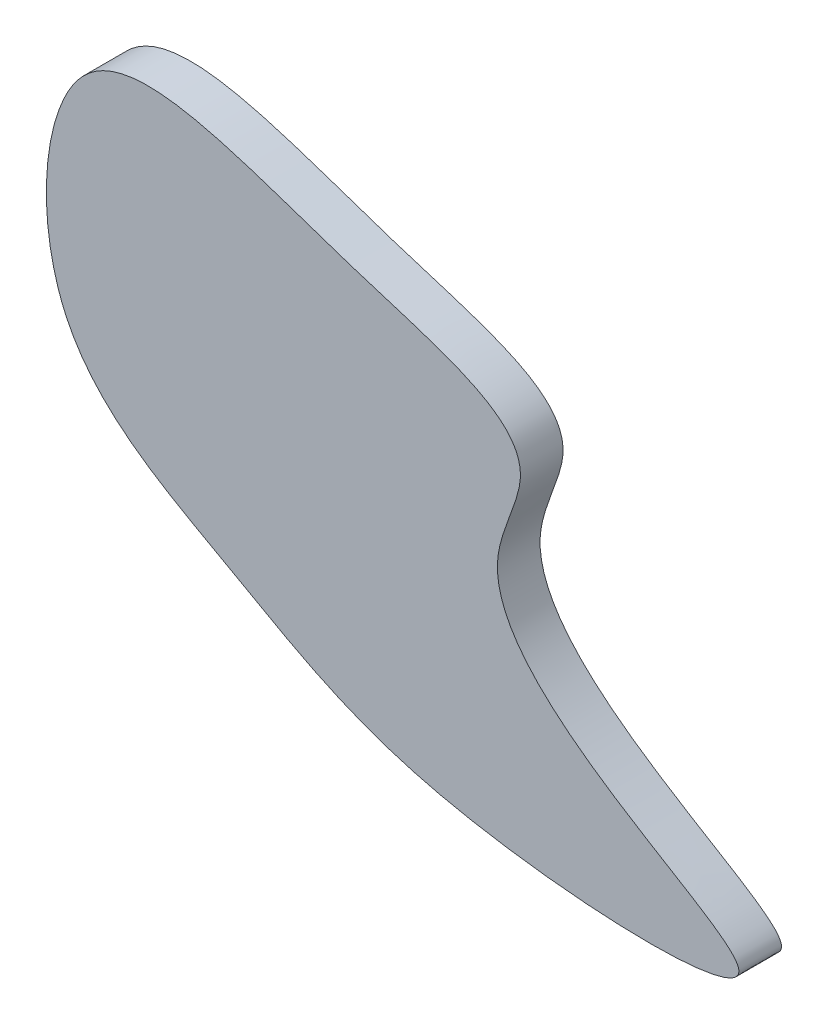
ISO-10303-21;
HEADER;
FILE_DESCRIPTION(('STEP AP214'),'2;1');
FILE_NAME('part.step','',(''),(''),'','','');
FILE_SCHEMA(('AUTOMOTIVE_DESIGN { 1 0 10303 214 1 1 1 1 }'));
ENDSEC;
DATA;
#1=APPLICATION_CONTEXT('core data for automotive mechanical design processes');
#2=APPLICATION_PROTOCOL_DEFINITION('international standard','automotive_design',2000,#1);
#3=PRODUCT_CONTEXT('',#1,'mechanical');
#4=PRODUCT('Part','Part','',(#3));
#5=PRODUCT_RELATED_PRODUCT_CATEGORY('part','',(#4));
#6=PRODUCT_DEFINITION_FORMATION('','',#4);
#7=PRODUCT_DEFINITION_CONTEXT('part definition',#1,'design');
#8=PRODUCT_DEFINITION('design','',#6,#7);
#9=PRODUCT_DEFINITION_SHAPE('','',#8);
#10=(LENGTH_UNIT() NAMED_UNIT(*) SI_UNIT(.MILLI.,.METRE.));
#11=(NAMED_UNIT(*) PLANE_ANGLE_UNIT() SI_UNIT($,.RADIAN.));
#12=(NAMED_UNIT(*) SI_UNIT($,.STERADIAN.) SOLID_ANGLE_UNIT());
#13=UNCERTAINTY_MEASURE_WITH_UNIT(LENGTH_MEASURE(1.E-05),#10,'distance_accuracy_value','');
#14=(GEOMETRIC_REPRESENTATION_CONTEXT(3) GLOBAL_UNCERTAINTY_ASSIGNED_CONTEXT((#13)) GLOBAL_UNIT_ASSIGNED_CONTEXT((#10,
#11,#12)) REPRESENTATION_CONTEXT('',''));
#15=CARTESIAN_POINT('',(0.,0.,0.));
#16=DIRECTION('',(0.,0.,1.));
#17=DIRECTION('',(1.,0.,0.));
#18=AXIS2_PLACEMENT_3D('',#15,#16,#17);
#19=CARTESIAN_POINT('',(-80.5382280056128,16.1125896796063,10.));
#20=CARTESIAN_POINT('',(-73.2223940572837,0.47451906370475,10.));
#21=CARTESIAN_POINT('',(-39.7737839332765,-16.204726599276,10.));
#22=CARTESIAN_POINT('',(0.660761158764566,-42.2798150218325,10.));
#23=CARTESIAN_POINT('',(127.962480815581,-47.4058385253257,10.));
#24=CARTESIAN_POINT('',(3.66498318277631,-3.73898254964805,10.));
#25=CARTESIAN_POINT('',(35.3577023898568,46.6962845426519,10.));
#26=CARTESIAN_POINT('',(-22.5259972455042,60.0214117269627,10.));
#27=CARTESIAN_POINT('',(-83.5489155866873,88.8453181613764,10.));
#28=CARTESIAN_POINT('',(-88.2095845352318,32.510612923059,10.));
#29=CARTESIAN_POINT('',(-80.5382280056128,16.1125896796063,10.));
#30=B_SPLINE_CURVE_WITH_KNOTS('',3,(#19,#20,#21,#22,#23,#24,#25,#26,#27,#28,#29),.UNSPECIFIED.,
.T.,.F.,(4,1,1,1,1,1,1,1,4),(0.,0.112755713866209,0.233476145338418,0.401323457957162,
0.583683402153783,0.629662186513237,0.730725300165199,0.881764773786732,1.),.UNSPECIFIED.);
#31=DIRECTION('',(0.,0.,-1.));
#32=VECTOR('',#31,1.);
#33=SURFACE_OF_LINEAR_EXTRUSION('',#30,#32);
#34=CARTESIAN_POINT('',(-80.5382280056128,16.1125896796063,10.));
#35=VERTEX_POINT('',#34);
#36=EDGE_CURVE('E10',#35,#35,#30,.T.);
#37=ORIENTED_EDGE('',*,*,#36,.F.);
#38=EDGE_LOOP('',(#37));
#39=FACE_BOUND('',#38,.T.);
#40=CARTESIAN_POINT('',(-80.5382280056128,16.1125896796063,0.));
#41=CARTESIAN_POINT('',(-73.2223940572837,0.47451906370475,0.));
#42=CARTESIAN_POINT('',(-39.7737839332765,-16.204726599276,0.));
#43=CARTESIAN_POINT('',(0.660761158764566,-42.2798150218325,0.));
#44=CARTESIAN_POINT('',(127.962480815581,-47.4058385253257,0.));
#45=CARTESIAN_POINT('',(3.66498318277631,-3.73898254964805,0.));
#46=CARTESIAN_POINT('',(35.3577023898568,46.6962845426519,0.));
#47=CARTESIAN_POINT('',(-22.5259972455042,60.0214117269627,0.));
#48=CARTESIAN_POINT('',(-83.5489155866873,88.8453181613764,0.));
#49=CARTESIAN_POINT('',(-88.2095845352318,32.510612923059,0.));
#50=CARTESIAN_POINT('',(-80.5382280056128,16.1125896796063,0.));
#51=B_SPLINE_CURVE_WITH_KNOTS('',3,(#40,#41,#42,#43,#44,#45,#46,#47,#48,#49,#50),.UNSPECIFIED.,
.T.,.F.,(4,1,1,1,1,1,1,1,4),(0.,0.112755713866209,0.233476145338418,0.401323457957162,
0.583683402153783,0.629662186513237,0.730725300165199,0.881764773786732,1.),.UNSPECIFIED.);
#52=CARTESIAN_POINT('',(-80.5382280056128,16.1125896796063,0.));
#53=VERTEX_POINT('',#52);
#54=EDGE_CURVE('E34',#53,#53,#51,.T.);
#55=ORIENTED_EDGE('',*,*,#54,.T.);
#56=EDGE_LOOP('',(#55));
#57=FACE_BOUND('',#56,.T.);
#58=ADVANCED_FACE('F30',(#39,#57),#33,.F.);
#59=CARTESIAN_POINT('',(43.7406298920644,-14.2765656980241,10.));
#60=DIRECTION('',(0.,0.,-1.));
#61=DIRECTION('',(-1.,0.,0.));
#62=AXIS2_PLACEMENT_3D('',#59,#60,#61);
#63=PLANE('',#62);
#64=ORIENTED_EDGE('',*,*,#36,.T.);
#65=EDGE_LOOP('',(#64));
#66=FACE_BOUND('',#65,.T.);
#67=ADVANCED_FACE('F53',(#66),#63,.F.);
#68=CARTESIAN_POINT('',(43.7406298920644,-14.2765656980241,0.));
#69=DIRECTION('',(0.,0.,-1.));
#70=DIRECTION('',(-1.,0.,0.));
#71=AXIS2_PLACEMENT_3D('',#68,#69,#70);
#72=PLANE('',#71);
#73=ORIENTED_EDGE('',*,*,#54,.F.);
#74=EDGE_LOOP('',(#73));
#75=FACE_BOUND('',#74,.T.);
#76=ADVANCED_FACE('F51',(#75),#72,.T.);
#77=CLOSED_SHELL('',(#58,#67,#76));
#78=MANIFOLD_SOLID_BREP('B2',#77);
#79=ADVANCED_BREP_SHAPE_REPRESENTATION('',(#18,#78),#14);
#80=SHAPE_DEFINITION_REPRESENTATION(#9,#79);
ENDSEC;
END-ISO-10303-21;
